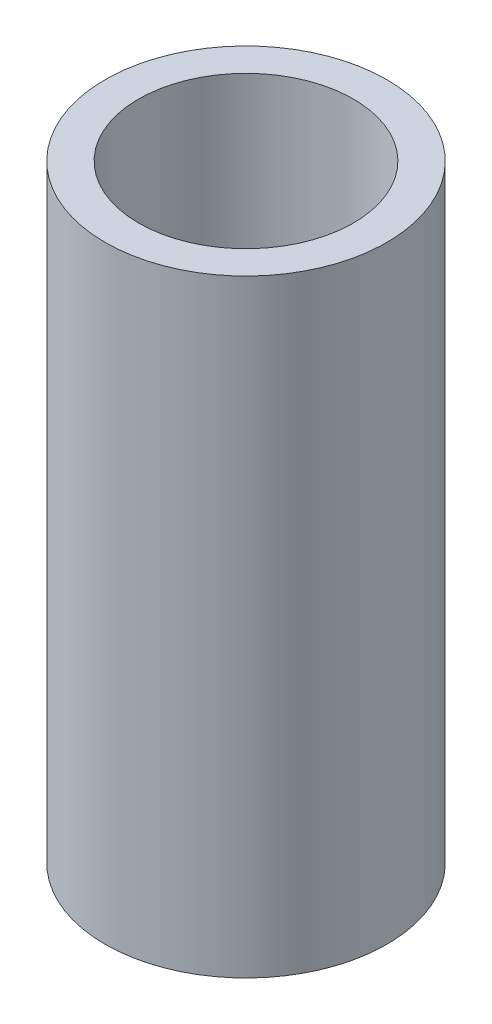
ISO-10303-21;
HEADER;
FILE_DESCRIPTION(('STEP AP214'),'2;1');
FILE_NAME('part.step','',(''),(''),'','','');
FILE_SCHEMA(('AUTOMOTIVE_DESIGN { 1 0 10303 214 1 1 1 1 }'));
ENDSEC;
DATA;
#1=APPLICATION_CONTEXT('core data for automotive mechanical design processes');
#2=APPLICATION_PROTOCOL_DEFINITION('international standard','automotive_design',2000,#1);
#3=PRODUCT_CONTEXT('',#1,'mechanical');
#4=PRODUCT('Part','Part','',(#3));
#5=PRODUCT_RELATED_PRODUCT_CATEGORY('part','',(#4));
#6=PRODUCT_DEFINITION_FORMATION('','',#4);
#7=PRODUCT_DEFINITION_CONTEXT('part definition',#1,'design');
#8=PRODUCT_DEFINITION('design','',#6,#7);
#9=PRODUCT_DEFINITION_SHAPE('','',#8);
#10=(LENGTH_UNIT() NAMED_UNIT(*) SI_UNIT(.MILLI.,.METRE.));
#11=(NAMED_UNIT(*) PLANE_ANGLE_UNIT() SI_UNIT($,.RADIAN.));
#12=(NAMED_UNIT(*) SI_UNIT($,.STERADIAN.) SOLID_ANGLE_UNIT());
#13=UNCERTAINTY_MEASURE_WITH_UNIT(LENGTH_MEASURE(1.E-05),#10,'distance_accuracy_value','');
#14=(GEOMETRIC_REPRESENTATION_CONTEXT(3) GLOBAL_UNCERTAINTY_ASSIGNED_CONTEXT((#13)) GLOBAL_UNIT_ASSIGNED_CONTEXT((#10,
#11,#12)) REPRESENTATION_CONTEXT('',''));
#15=CARTESIAN_POINT('',(0.,0.,0.));
#16=DIRECTION('',(0.,0.,1.));
#17=DIRECTION('',(1.,0.,0.));
#18=AXIS2_PLACEMENT_3D('',#15,#16,#17);
#19=CARTESIAN_POINT('',(0.,140.209065321086,0.));
#20=DIRECTION('',(0.,-1.,0.));
#21=DIRECTION('',(0.,0.,-1.));
#22=AXIS2_PLACEMENT_3D('',#19,#20,#21);
#23=CYLINDRICAL_SURFACE('',#22,32.5);
#24=CARTESIAN_POINT('',(0.,140.209065321086,0.));
#25=DIRECTION('',(0.,1.,0.));
#26=DIRECTION('',(0.,0.,1.));
#27=AXIS2_PLACEMENT_3D('',#24,#25,#26);
#28=CIRCLE('',#27,32.5);
#29=CARTESIAN_POINT('',(0.,140.209065321086,32.5));
#30=VERTEX_POINT('',#29);
#31=EDGE_CURVE('E10',#30,#30,#28,.T.);
#32=ORIENTED_EDGE('',*,*,#31,.F.);
#33=EDGE_LOOP('',(#32));
#34=FACE_BOUND('',#33,.T.);
#35=CARTESIAN_POINT('',(0.,0.,0.));
#36=DIRECTION('',(0.,1.,0.));
#37=DIRECTION('',(0.,0.,1.));
#38=AXIS2_PLACEMENT_3D('',#35,#36,#37);
#39=CIRCLE('',#38,32.5);
#40=CARTESIAN_POINT('',(0.,0.,32.5));
#41=VERTEX_POINT('',#40);
#42=EDGE_CURVE('E37',#41,#41,#39,.T.);
#43=ORIENTED_EDGE('',*,*,#42,.T.);
#44=EDGE_LOOP('',(#43));
#45=FACE_BOUND('',#44,.T.);
#46=ADVANCED_FACE('F40',(#34,#45),#23,.T.);
#47=CARTESIAN_POINT('',(0.,140.209065321086,0.));
#48=DIRECTION('',(0.,1.,0.));
#49=DIRECTION('',(0.,0.,1.));
#50=AXIS2_PLACEMENT_3D('',#47,#48,#49);
#51=PLANE('',#50);
#52=CARTESIAN_POINT('',(0.,140.209065321086,0.));
#53=DIRECTION('',(0.,1.,0.));
#54=DIRECTION('',(0.,0.,1.));
#55=AXIS2_PLACEMENT_3D('',#52,#53,#54);
#56=CIRCLE('',#55,24.7783364358855);
#57=CARTESIAN_POINT('',(0.,140.209065321086,24.7783364358855));
#58=VERTEX_POINT('',#57);
#59=EDGE_CURVE('E50',#58,#58,#56,.T.);
#60=ORIENTED_EDGE('',*,*,#59,.F.);
#61=EDGE_LOOP('',(#60));
#62=FACE_BOUND('',#61,.T.);
#63=ORIENTED_EDGE('',*,*,#31,.T.);
#64=EDGE_LOOP('',(#63));
#65=FACE_BOUND('',#64,.T.);
#66=ADVANCED_FACE('F59',(#62,#65),#51,.T.);
#67=CARTESIAN_POINT('',(0.,0.,0.));
#68=DIRECTION('',(0.,1.,0.));
#69=DIRECTION('',(0.,0.,1.));
#70=AXIS2_PLACEMENT_3D('',#67,#68,#69);
#71=PLANE('',#70);
#72=CARTESIAN_POINT('',(0.,0.,0.));
#73=DIRECTION('',(0.,1.,0.));
#74=DIRECTION('',(0.,0.,1.));
#75=AXIS2_PLACEMENT_3D('',#72,#73,#74);
#76=CIRCLE('',#75,24.7783364358855);
#77=CARTESIAN_POINT('',(0.,0.,24.7783364358855));
#78=VERTEX_POINT('',#77);
#79=EDGE_CURVE('E47',#78,#78,#76,.T.);
#80=ORIENTED_EDGE('',*,*,#79,.T.);
#81=EDGE_LOOP('',(#80));
#82=FACE_BOUND('',#81,.T.);
#83=ORIENTED_EDGE('',*,*,#42,.F.);
#84=EDGE_LOOP('',(#83));
#85=FACE_BOUND('',#84,.T.);
#86=ADVANCED_FACE('F58',(#82,#85),#71,.F.);
#87=CARTESIAN_POINT('',(0.,140.209065321086,0.));
#88=DIRECTION('',(0.,-1.,0.));
#89=DIRECTION('',(0.,0.,-1.));
#90=AXIS2_PLACEMENT_3D('',#87,#88,#89);
#91=CYLINDRICAL_SURFACE('',#90,24.7783364358855);
#92=ORIENTED_EDGE('',*,*,#59,.T.);
#93=EDGE_LOOP('',(#92));
#94=FACE_BOUND('',#93,.T.);
#95=ORIENTED_EDGE('',*,*,#79,.F.);
#96=EDGE_LOOP('',(#95));
#97=FACE_BOUND('',#96,.T.);
#98=ADVANCED_FACE('F54',(#94,#97),#91,.F.);
#99=CLOSED_SHELL('',(#46,#66,#86,#98));
#100=MANIFOLD_SOLID_BREP('B2',#99);
#101=ADVANCED_BREP_SHAPE_REPRESENTATION('',(#18,#100),#14);
#102=SHAPE_DEFINITION_REPRESENTATION(#9,#101);
ENDSEC;
END-ISO-10303-21;
